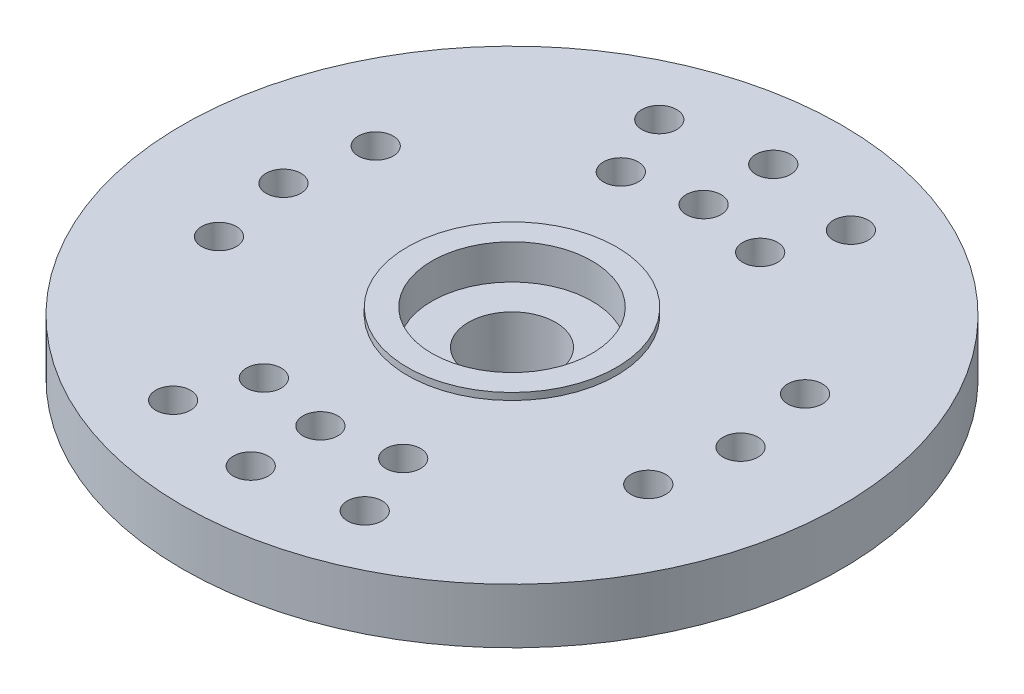
ISO-10303-21;
HEADER;
FILE_DESCRIPTION(('STEP AP214'),'2;1');
FILE_NAME('part.step','',(''),(''),'','','');
FILE_SCHEMA(('AUTOMOTIVE_DESIGN { 1 0 10303 214 1 1 1 1 }'));
ENDSEC;
DATA;
#1=APPLICATION_CONTEXT('core data for automotive mechanical design processes');
#2=APPLICATION_PROTOCOL_DEFINITION('international standard','automotive_design',2000,#1);
#3=PRODUCT_CONTEXT('',#1,'mechanical');
#4=PRODUCT('Part','Part','',(#3));
#5=PRODUCT_RELATED_PRODUCT_CATEGORY('part','',(#4));
#6=PRODUCT_DEFINITION_FORMATION('','',#4);
#7=PRODUCT_DEFINITION_CONTEXT('part definition',#1,'design');
#8=PRODUCT_DEFINITION('design','',#6,#7);
#9=PRODUCT_DEFINITION_SHAPE('','',#8);
#10=(LENGTH_UNIT() NAMED_UNIT(*) SI_UNIT(.MILLI.,.METRE.));
#11=(NAMED_UNIT(*) PLANE_ANGLE_UNIT() SI_UNIT($,.RADIAN.));
#12=(NAMED_UNIT(*) SI_UNIT($,.STERADIAN.) SOLID_ANGLE_UNIT());
#13=UNCERTAINTY_MEASURE_WITH_UNIT(LENGTH_MEASURE(1.E-05),#10,'distance_accuracy_value','');
#14=(GEOMETRIC_REPRESENTATION_CONTEXT(3) GLOBAL_UNCERTAINTY_ASSIGNED_CONTEXT((#13)) GLOBAL_UNIT_ASSIGNED_CONTEXT((#10,
#11,#12)) REPRESENTATION_CONTEXT('',''));
#15=CARTESIAN_POINT('',(0.,0.,0.));
#16=DIRECTION('',(0.,0.,1.));
#17=DIRECTION('',(1.,0.,0.));
#18=AXIS2_PLACEMENT_3D('',#15,#16,#17);
#19=CARTESIAN_POINT('',(4.5212,0.,0.));
#20=DIRECTION('',(0.,-1.,0.));
#21=DIRECTION('',(0.,0.,-1.));
#22=AXIS2_PLACEMENT_3D('',#19,#20,#21);
#23=PLANE('',#22);
#24=CARTESIAN_POINT('',(0.,0.,0.));
#25=DIRECTION('',(0.,-1.,0.));
#26=DIRECTION('',(0.,0.,-1.));
#27=AXIS2_PLACEMENT_3D('',#24,#25,#26);
#28=CIRCLE('',#27,1.5875);
#29=CARTESIAN_POINT('',(0.,0.,-1.5875));
#30=VERTEX_POINT('',#29);
#31=EDGE_CURVE('E54',#30,#30,#28,.T.);
#32=ORIENTED_EDGE('',*,*,#31,.F.);
#33=EDGE_LOOP('',(#32));
#34=FACE_BOUND('',#33,.T.);
#35=CARTESIAN_POINT('',(0.,0.,0.));
#36=DIRECTION('',(0.,-1.,0.));
#37=DIRECTION('',(0.,0.,-1.));
#38=AXIS2_PLACEMENT_3D('',#35,#36,#37);
#39=CIRCLE('',#38,4.5212);
#40=CARTESIAN_POINT('',(0.,0.,-4.5212));
#41=VERTEX_POINT('',#40);
#42=EDGE_CURVE('E168',#41,#41,#39,.T.);
#43=ORIENTED_EDGE('',*,*,#42,.T.);
#44=EDGE_LOOP('',(#43));
#45=FACE_BOUND('',#44,.T.);
#46=ADVANCED_FACE('F34',(#34,#45),#23,.T.);
#47=CARTESIAN_POINT('',(0.,4.445,0.));
#48=DIRECTION('',(0.,1.,0.));
#49=DIRECTION('',(0.,0.,1.));
#50=AXIS2_PLACEMENT_3D('',#47,#48,#49);
#51=PLANE('',#50);
#52=CARTESIAN_POINT('',(0.,4.445,0.));
#53=DIRECTION('',(0.,1.,0.));
#54=DIRECTION('',(0.,0.,1.));
#55=AXIS2_PLACEMENT_3D('',#52,#53,#54);
#56=CIRCLE('',#55,2.921);
#57=CARTESIAN_POINT('',(0.,4.445,2.921));
#58=VERTEX_POINT('',#57);
#59=EDGE_CURVE('E53',#58,#58,#56,.T.);
#60=ORIENTED_EDGE('',*,*,#59,.F.);
#61=EDGE_LOOP('',(#60));
#62=FACE_BOUND('',#61,.T.);
#63=CARTESIAN_POINT('',(0.,4.445,0.));
#64=DIRECTION('',(0.,-1.,0.));
#65=DIRECTION('',(0.,0.,-1.));
#66=AXIS2_PLACEMENT_3D('',#63,#64,#65);
#67=CIRCLE('',#66,3.81);
#68=CARTESIAN_POINT('',(0.,4.445,-3.81));
#69=VERTEX_POINT('',#68);
#70=EDGE_CURVE('E10',#69,#69,#67,.T.);
#71=ORIENTED_EDGE('',*,*,#70,.F.);
#72=EDGE_LOOP('',(#71));
#73=FACE_BOUND('',#72,.T.);
#74=ADVANCED_FACE('F195',(#62,#73),#51,.T.);
#75=CARTESIAN_POINT('',(0.,0.,0.));
#76=DIRECTION('',(0.,-1.,0.));
#77=DIRECTION('',(0.,0.,-1.));
#78=AXIS2_PLACEMENT_3D('',#75,#76,#77);
#79=CYLINDRICAL_SURFACE('',#78,3.81);
#80=ORIENTED_EDGE('',*,*,#70,.T.);
#81=EDGE_LOOP('',(#80));
#82=FACE_BOUND('',#81,.T.);
#83=CARTESIAN_POINT('',(0.,4.191,0.));
#84=DIRECTION('',(0.,-1.,0.));
#85=DIRECTION('',(0.,0.,-1.));
#86=AXIS2_PLACEMENT_3D('',#83,#84,#85);
#87=CIRCLE('',#86,3.81);
#88=CARTESIAN_POINT('',(0.,4.191,-3.81));
#89=VERTEX_POINT('',#88);
#90=EDGE_CURVE('E41',#89,#89,#87,.T.);
#91=ORIENTED_EDGE('',*,*,#90,.F.);
#92=EDGE_LOOP('',(#91));
#93=FACE_BOUND('',#92,.T.);
#94=ADVANCED_FACE('F186',(#82,#93),#79,.T.);
#95=CARTESIAN_POINT('',(3.81,4.191,0.));
#96=DIRECTION('',(0.,1.,0.));
#97=DIRECTION('',(0.,0.,1.));
#98=AXIS2_PLACEMENT_3D('',#95,#96,#97);
#99=PLANE('',#98);
#100=CARTESIAN_POINT('',(-3.4925,4.191,8.86160644296507));
#101=DIRECTION('',(0.,1.,0.));
#102=DIRECTION('',(0.,0.,1.));
#103=AXIS2_PLACEMENT_3D('',#100,#101,#102);
#104=CIRCLE('',#103,0.635);
#105=CARTESIAN_POINT('',(-3.4925,4.191,9.49660644296507));
#106=VERTEX_POINT('',#105);
#107=EDGE_CURVE('E130',#106,#106,#104,.T.);
#108=ORIENTED_EDGE('',*,*,#107,.F.);
#109=EDGE_LOOP('',(#108));
#110=FACE_BOUND('',#109,.T.);
#111=CARTESIAN_POINT('',(0.,4.191,9.525));
#112=DIRECTION('',(0.,1.,0.));
#113=DIRECTION('',(0.,0.,1.));
#114=AXIS2_PLACEMENT_3D('',#111,#112,#113);
#115=CIRCLE('',#114,0.635);
#116=CARTESIAN_POINT('',(0.,4.191,10.16));
#117=VERTEX_POINT('',#116);
#118=EDGE_CURVE('E120',#117,#117,#115,.T.);
#119=ORIENTED_EDGE('',*,*,#118,.F.);
#120=EDGE_LOOP('',(#119));
#121=FACE_BOUND('',#120,.T.);
#122=CARTESIAN_POINT('',(3.4925,4.191,8.86160644296507));
#123=DIRECTION('',(0.,1.,0.));
#124=DIRECTION('',(0.,0.,1.));
#125=AXIS2_PLACEMENT_3D('',#122,#123,#124);
#126=CIRCLE('',#125,0.635);
#127=CARTESIAN_POINT('',(3.4925,4.191,9.49660644296507));
#128=VERTEX_POINT('',#127);
#129=EDGE_CURVE('E117',#128,#128,#126,.T.);
#130=ORIENTED_EDGE('',*,*,#129,.F.);
#131=EDGE_LOOP('',(#130));
#132=FACE_BOUND('',#131,.T.);
#133=CARTESIAN_POINT('',(-3.4925,4.191,-8.86160644296507));
#134=DIRECTION('',(0.,1.,0.));
#135=DIRECTION('',(0.,0.,1.));
#136=AXIS2_PLACEMENT_3D('',#133,#134,#135);
#137=CIRCLE('',#136,0.635);
#138=CARTESIAN_POINT('',(-3.4925,4.191,-8.22660644296507));
#139=VERTEX_POINT('',#138);
#140=EDGE_CURVE('E114',#139,#139,#137,.T.);
#141=ORIENTED_EDGE('',*,*,#140,.F.);
#142=EDGE_LOOP('',(#141));
#143=FACE_BOUND('',#142,.T.);
#144=CARTESIAN_POINT('',(3.4925,4.191,-8.86160644296507));
#145=DIRECTION('',(0.,1.,0.));
#146=DIRECTION('',(0.,0.,1.));
#147=AXIS2_PLACEMENT_3D('',#144,#145,#146);
#148=CIRCLE('',#147,0.634999999999999);
#149=CARTESIAN_POINT('',(3.4925,4.191,-8.22660644296507));
#150=VERTEX_POINT('',#149);
#151=EDGE_CURVE('E110',#150,#150,#148,.T.);
#152=ORIENTED_EDGE('',*,*,#151,.F.);
#153=EDGE_LOOP('',(#152));
#154=FACE_BOUND('',#153,.T.);
#155=CARTESIAN_POINT('',(0.,4.191,-9.525));
#156=DIRECTION('',(0.,1.,0.));
#157=DIRECTION('',(0.,0.,1.));
#158=AXIS2_PLACEMENT_3D('',#155,#156,#157);
#159=CIRCLE('',#158,0.635);
#160=CARTESIAN_POINT('',(0.,4.191,-8.89));
#161=VERTEX_POINT('',#160);
#162=EDGE_CURVE('E106',#161,#161,#159,.T.);
#163=ORIENTED_EDGE('',*,*,#162,.F.);
#164=EDGE_LOOP('',(#163));
#165=FACE_BOUND('',#164,.T.);
#166=CARTESIAN_POINT('',(-2.54,4.191,6.50681373638435));
#167=DIRECTION('',(0.,1.,0.));
#168=DIRECTION('',(0.,0.,1.));
#169=AXIS2_PLACEMENT_3D('',#166,#167,#168);
#170=CIRCLE('',#169,0.635);
#171=CARTESIAN_POINT('',(-2.54,4.191,7.14181373638435));
#172=VERTEX_POINT('',#171);
#173=EDGE_CURVE('E102',#172,#172,#170,.T.);
#174=ORIENTED_EDGE('',*,*,#173,.F.);
#175=EDGE_LOOP('',(#174));
#176=FACE_BOUND('',#175,.T.);
#177=CARTESIAN_POINT('',(0.,4.191,6.985));
#178=DIRECTION('',(0.,1.,0.));
#179=DIRECTION('',(0.,0.,1.));
#180=AXIS2_PLACEMENT_3D('',#177,#178,#179);
#181=CIRCLE('',#180,0.635);
#182=CARTESIAN_POINT('',(0.,4.191,7.62));
#183=VERTEX_POINT('',#182);
#184=EDGE_CURVE('E98',#183,#183,#181,.T.);
#185=ORIENTED_EDGE('',*,*,#184,.F.);
#186=EDGE_LOOP('',(#185));
#187=FACE_BOUND('',#186,.T.);
#188=CARTESIAN_POINT('',(2.54,4.191,6.50681373638435));
#189=DIRECTION('',(0.,1.,0.));
#190=DIRECTION('',(0.,0.,1.));
#191=AXIS2_PLACEMENT_3D('',#188,#189,#190);
#192=CIRCLE('',#191,0.635);
#193=CARTESIAN_POINT('',(2.54,4.191,7.14181373638435));
#194=VERTEX_POINT('',#193);
#195=EDGE_CURVE('E94',#194,#194,#192,.T.);
#196=ORIENTED_EDGE('',*,*,#195,.F.);
#197=EDGE_LOOP('',(#196));
#198=FACE_BOUND('',#197,.T.);
#199=CARTESIAN_POINT('',(-2.54,4.191,-6.50681373638435));
#200=DIRECTION('',(0.,1.,0.));
#201=DIRECTION('',(0.,0.,1.));
#202=AXIS2_PLACEMENT_3D('',#199,#200,#201);
#203=CIRCLE('',#202,0.635);
#204=CARTESIAN_POINT('',(-2.54,4.191,-5.87181373638435));
#205=VERTEX_POINT('',#204);
#206=EDGE_CURVE('E90',#205,#205,#203,.T.);
#207=ORIENTED_EDGE('',*,*,#206,.F.);
#208=EDGE_LOOP('',(#207));
#209=FACE_BOUND('',#208,.T.);
#210=CARTESIAN_POINT('',(2.54,4.191,-6.50681373638435));
#211=DIRECTION('',(0.,1.,0.));
#212=DIRECTION('',(0.,0.,1.));
#213=AXIS2_PLACEMENT_3D('',#210,#211,#212);
#214=CIRCLE('',#213,0.635);
#215=CARTESIAN_POINT('',(2.54,4.191,-5.87181373638435));
#216=VERTEX_POINT('',#215);
#217=EDGE_CURVE('E86',#216,#216,#214,.T.);
#218=ORIENTED_EDGE('',*,*,#217,.F.);
#219=EDGE_LOOP('',(#218));
#220=FACE_BOUND('',#219,.T.);
#221=CARTESIAN_POINT('',(7.82582821112245,4.191,2.8575));
#222=DIRECTION('',(0.,1.,0.));
#223=DIRECTION('',(0.,0.,1.));
#224=AXIS2_PLACEMENT_3D('',#221,#222,#223);
#225=CIRCLE('',#224,0.635000000000001);
#226=CARTESIAN_POINT('',(7.82582821112245,4.191,3.4925));
#227=VERTEX_POINT('',#226);
#228=EDGE_CURVE('E82',#227,#227,#225,.T.);
#229=ORIENTED_EDGE('',*,*,#228,.F.);
#230=EDGE_LOOP('',(#229));
#231=FACE_BOUND('',#230,.T.);
#232=CARTESIAN_POINT('',(8.3312,4.191,0.));
#233=DIRECTION('',(0.,1.,0.));
#234=DIRECTION('',(0.,0.,1.));
#235=AXIS2_PLACEMENT_3D('',#232,#233,#234);
#236=CIRCLE('',#235,0.635000000000001);
#237=CARTESIAN_POINT('',(8.3312,4.191,0.635000000000002));
#238=VERTEX_POINT('',#237);
#239=EDGE_CURVE('E78',#238,#238,#236,.T.);
#240=ORIENTED_EDGE('',*,*,#239,.F.);
#241=EDGE_LOOP('',(#240));
#242=FACE_BOUND('',#241,.T.);
#243=CARTESIAN_POINT('',(7.82582821112245,4.191,-2.8575));
#244=DIRECTION('',(0.,1.,0.));
#245=DIRECTION('',(0.,0.,1.));
#246=AXIS2_PLACEMENT_3D('',#243,#244,#245);
#247=CIRCLE('',#246,0.635000000000001);
#248=CARTESIAN_POINT('',(7.82582821112245,4.191,-2.2225));
#249=VERTEX_POINT('',#248);
#250=EDGE_CURVE('E74',#249,#249,#247,.T.);
#251=ORIENTED_EDGE('',*,*,#250,.F.);
#252=EDGE_LOOP('',(#251));
#253=FACE_BOUND('',#252,.T.);
#254=CARTESIAN_POINT('',(-7.82582821112245,4.191,2.8575));
#255=DIRECTION('',(0.,1.,0.));
#256=DIRECTION('',(0.,0.,1.));
#257=AXIS2_PLACEMENT_3D('',#254,#255,#256);
#258=CIRCLE('',#257,0.635000000000001);
#259=CARTESIAN_POINT('',(-7.82582821112245,4.191,3.4925));
#260=VERTEX_POINT('',#259);
#261=EDGE_CURVE('E70',#260,#260,#258,.T.);
#262=ORIENTED_EDGE('',*,*,#261,.F.);
#263=EDGE_LOOP('',(#262));
#264=FACE_BOUND('',#263,.T.);
#265=CARTESIAN_POINT('',(-8.3312,4.191,0.));
#266=DIRECTION('',(0.,1.,0.));
#267=DIRECTION('',(0.,0.,1.));
#268=AXIS2_PLACEMENT_3D('',#265,#266,#267);
#269=CIRCLE('',#268,0.635000000000001);
#270=CARTESIAN_POINT('',(-8.3312,4.191,0.635000000000002));
#271=VERTEX_POINT('',#270);
#272=EDGE_CURVE('E66',#271,#271,#269,.T.);
#273=ORIENTED_EDGE('',*,*,#272,.F.);
#274=EDGE_LOOP('',(#273));
#275=FACE_BOUND('',#274,.T.);
#276=CARTESIAN_POINT('',(-7.82582821112245,4.191,-2.8575));
#277=DIRECTION('',(0.,1.,0.));
#278=DIRECTION('',(0.,0.,1.));
#279=AXIS2_PLACEMENT_3D('',#276,#277,#278);
#280=CIRCLE('',#279,0.635000000000001);
#281=CARTESIAN_POINT('',(-7.82582821112245,4.191,-2.2225));
#282=VERTEX_POINT('',#281);
#283=EDGE_CURVE('E62',#282,#282,#280,.T.);
#284=ORIENTED_EDGE('',*,*,#283,.F.);
#285=EDGE_LOOP('',(#284));
#286=FACE_BOUND('',#285,.T.);
#287=CARTESIAN_POINT('',(0.,4.191,-6.985));
#288=DIRECTION('',(0.,1.,0.));
#289=DIRECTION('',(0.,0.,1.));
#290=AXIS2_PLACEMENT_3D('',#287,#288,#289);
#291=CIRCLE('',#290,0.635);
#292=CARTESIAN_POINT('',(0.,4.191,-6.35));
#293=VERTEX_POINT('',#292);
#294=EDGE_CURVE('E58',#293,#293,#291,.T.);
#295=ORIENTED_EDGE('',*,*,#294,.F.);
#296=EDGE_LOOP('',(#295));
#297=FACE_BOUND('',#296,.T.);
#298=ORIENTED_EDGE('',*,*,#90,.T.);
#299=EDGE_LOOP('',(#298));
#300=FACE_BOUND('',#299,.T.);
#301=CARTESIAN_POINT('',(0.,4.191,0.));
#302=DIRECTION('',(0.,-1.,0.));
#303=DIRECTION('',(0.,0.,-1.));
#304=AXIS2_PLACEMENT_3D('',#301,#302,#303);
#305=CIRCLE('',#304,12.0142);
#306=CARTESIAN_POINT('',(0.,4.191,-12.0142));
#307=VERTEX_POINT('',#306);
#308=EDGE_CURVE('E46',#307,#307,#305,.T.);
#309=ORIENTED_EDGE('',*,*,#308,.F.);
#310=EDGE_LOOP('',(#309));
#311=FACE_BOUND('',#310,.T.);
#312=ADVANCED_FACE('F184',(#110,#121,#132,#143,#154,#165,#176,#187,#198,#209,#220,#231,#242,
#253,#264,#275,#286,#297,#300,#311),#99,.T.);
#313=CARTESIAN_POINT('',(0.,0.,0.));
#314=DIRECTION('',(0.,-1.,0.));
#315=DIRECTION('',(0.,0.,-1.));
#316=AXIS2_PLACEMENT_3D('',#313,#314,#315);
#317=CYLINDRICAL_SURFACE('',#316,12.0142);
#318=ORIENTED_EDGE('',*,*,#308,.T.);
#319=EDGE_LOOP('',(#318));
#320=FACE_BOUND('',#319,.T.);
#321=CARTESIAN_POINT('',(0.,2.1844,0.));
#322=DIRECTION('',(0.,-1.,0.));
#323=DIRECTION('',(0.,0.,-1.));
#324=AXIS2_PLACEMENT_3D('',#321,#322,#323);
#325=CIRCLE('',#324,12.0142);
#326=CARTESIAN_POINT('',(0.,2.1844,-12.0142));
#327=VERTEX_POINT('',#326);
#328=EDGE_CURVE('E176',#327,#327,#325,.T.);
#329=ORIENTED_EDGE('',*,*,#328,.F.);
#330=EDGE_LOOP('',(#329));
#331=FACE_BOUND('',#330,.T.);
#332=ADVANCED_FACE('F181',(#320,#331),#317,.T.);
#333=CARTESIAN_POINT('',(12.0142,2.1844,0.));
#334=DIRECTION('',(0.,-1.,0.));
#335=DIRECTION('',(0.,0.,-1.));
#336=AXIS2_PLACEMENT_3D('',#333,#334,#335);
#337=PLANE('',#336);
#338=CARTESIAN_POINT('',(-3.4925,2.1844,8.86160644296507));
#339=DIRECTION('',(0.,-1.,0.));
#340=DIRECTION('',(0.,0.,-1.));
#341=AXIS2_PLACEMENT_3D('',#338,#339,#340);
#342=CIRCLE('',#341,0.635);
#343=CARTESIAN_POINT('',(-3.4925,2.1844,8.22660644296507));
#344=VERTEX_POINT('',#343);
#345=EDGE_CURVE('E37',#344,#344,#342,.T.);
#346=ORIENTED_EDGE('',*,*,#345,.F.);
#347=EDGE_LOOP('',(#346));
#348=FACE_BOUND('',#347,.T.);
#349=CARTESIAN_POINT('',(0.,2.1844,9.525));
#350=DIRECTION('',(0.,-1.,0.));
#351=DIRECTION('',(0.,0.,-1.));
#352=AXIS2_PLACEMENT_3D('',#349,#350,#351);
#353=CIRCLE('',#352,0.635);
#354=CARTESIAN_POINT('',(0.,2.1844,8.89));
#355=VERTEX_POINT('',#354);
#356=EDGE_CURVE('E118',#355,#355,#353,.T.);
#357=ORIENTED_EDGE('',*,*,#356,.F.);
#358=EDGE_LOOP('',(#357));
#359=FACE_BOUND('',#358,.T.);
#360=CARTESIAN_POINT('',(3.4925,2.1844,8.86160644296507));
#361=DIRECTION('',(0.,-1.,0.));
#362=DIRECTION('',(0.,0.,-1.));
#363=AXIS2_PLACEMENT_3D('',#360,#361,#362);
#364=CIRCLE('',#363,0.635);
#365=CARTESIAN_POINT('',(3.4925,2.1844,8.22660644296507));
#366=VERTEX_POINT('',#365);
#367=EDGE_CURVE('E115',#366,#366,#364,.T.);
#368=ORIENTED_EDGE('',*,*,#367,.F.);
#369=EDGE_LOOP('',(#368));
#370=FACE_BOUND('',#369,.T.);
#371=CARTESIAN_POINT('',(-3.4925,2.1844,-8.86160644296507));
#372=DIRECTION('',(0.,-1.,0.));
#373=DIRECTION('',(0.,0.,-1.));
#374=AXIS2_PLACEMENT_3D('',#371,#372,#373);
#375=CIRCLE('',#374,0.635);
#376=CARTESIAN_POINT('',(-3.4925,2.1844,-9.49660644296507));
#377=VERTEX_POINT('',#376);
#378=EDGE_CURVE('E111',#377,#377,#375,.T.);
#379=ORIENTED_EDGE('',*,*,#378,.F.);
#380=EDGE_LOOP('',(#379));
#381=FACE_BOUND('',#380,.T.);
#382=CARTESIAN_POINT('',(3.4925,2.1844,-8.86160644296507));
#383=DIRECTION('',(0.,-1.,0.));
#384=DIRECTION('',(0.,0.,-1.));
#385=AXIS2_PLACEMENT_3D('',#382,#383,#384);
#386=CIRCLE('',#385,0.634999999999999);
#387=CARTESIAN_POINT('',(3.4925,2.1844,-9.49660644296507));
#388=VERTEX_POINT('',#387);
#389=EDGE_CURVE('E107',#388,#388,#386,.T.);
#390=ORIENTED_EDGE('',*,*,#389,.F.);
#391=EDGE_LOOP('',(#390));
#392=FACE_BOUND('',#391,.T.);
#393=CARTESIAN_POINT('',(0.,2.1844,-9.525));
#394=DIRECTION('',(0.,-1.,0.));
#395=DIRECTION('',(0.,0.,-1.));
#396=AXIS2_PLACEMENT_3D('',#393,#394,#395);
#397=CIRCLE('',#396,0.635);
#398=CARTESIAN_POINT('',(0.,2.1844,-10.16));
#399=VERTEX_POINT('',#398);
#400=EDGE_CURVE('E103',#399,#399,#397,.T.);
#401=ORIENTED_EDGE('',*,*,#400,.F.);
#402=EDGE_LOOP('',(#401));
#403=FACE_BOUND('',#402,.T.);
#404=CARTESIAN_POINT('',(-2.54,2.1844,6.50681373638435));
#405=DIRECTION('',(0.,-1.,0.));
#406=DIRECTION('',(0.,0.,-1.));
#407=AXIS2_PLACEMENT_3D('',#404,#405,#406);
#408=CIRCLE('',#407,0.635);
#409=CARTESIAN_POINT('',(-2.54,2.1844,5.87181373638435));
#410=VERTEX_POINT('',#409);
#411=EDGE_CURVE('E99',#410,#410,#408,.T.);
#412=ORIENTED_EDGE('',*,*,#411,.F.);
#413=EDGE_LOOP('',(#412));
#414=FACE_BOUND('',#413,.T.);
#415=CARTESIAN_POINT('',(0.,2.1844,6.985));
#416=DIRECTION('',(0.,-1.,0.));
#417=DIRECTION('',(0.,0.,-1.));
#418=AXIS2_PLACEMENT_3D('',#415,#416,#417);
#419=CIRCLE('',#418,0.635);
#420=CARTESIAN_POINT('',(0.,2.1844,6.35));
#421=VERTEX_POINT('',#420);
#422=EDGE_CURVE('E95',#421,#421,#419,.T.);
#423=ORIENTED_EDGE('',*,*,#422,.F.);
#424=EDGE_LOOP('',(#423));
#425=FACE_BOUND('',#424,.T.);
#426=CARTESIAN_POINT('',(2.54,2.1844,6.50681373638435));
#427=DIRECTION('',(0.,-1.,0.));
#428=DIRECTION('',(0.,0.,-1.));
#429=AXIS2_PLACEMENT_3D('',#426,#427,#428);
#430=CIRCLE('',#429,0.635);
#431=CARTESIAN_POINT('',(2.54,2.1844,5.87181373638435));
#432=VERTEX_POINT('',#431);
#433=EDGE_CURVE('E91',#432,#432,#430,.T.);
#434=ORIENTED_EDGE('',*,*,#433,.F.);
#435=EDGE_LOOP('',(#434));
#436=FACE_BOUND('',#435,.T.);
#437=CARTESIAN_POINT('',(-2.54,2.1844,-6.50681373638435));
#438=DIRECTION('',(0.,-1.,0.));
#439=DIRECTION('',(0.,0.,-1.));
#440=AXIS2_PLACEMENT_3D('',#437,#438,#439);
#441=CIRCLE('',#440,0.635);
#442=CARTESIAN_POINT('',(-2.54,2.1844,-7.14181373638435));
#443=VERTEX_POINT('',#442);
#444=EDGE_CURVE('E87',#443,#443,#441,.T.);
#445=ORIENTED_EDGE('',*,*,#444,.F.);
#446=EDGE_LOOP('',(#445));
#447=FACE_BOUND('',#446,.T.);
#448=CARTESIAN_POINT('',(2.54,2.1844,-6.50681373638435));
#449=DIRECTION('',(0.,-1.,0.));
#450=DIRECTION('',(0.,0.,-1.));
#451=AXIS2_PLACEMENT_3D('',#448,#449,#450);
#452=CIRCLE('',#451,0.635);
#453=CARTESIAN_POINT('',(2.54,2.1844,-7.14181373638435));
#454=VERTEX_POINT('',#453);
#455=EDGE_CURVE('E83',#454,#454,#452,.T.);
#456=ORIENTED_EDGE('',*,*,#455,.F.);
#457=EDGE_LOOP('',(#456));
#458=FACE_BOUND('',#457,.T.);
#459=CARTESIAN_POINT('',(7.82582821112245,2.1844,2.8575));
#460=DIRECTION('',(0.,-1.,0.));
#461=DIRECTION('',(0.,0.,-1.));
#462=AXIS2_PLACEMENT_3D('',#459,#460,#461);
#463=CIRCLE('',#462,0.635000000000001);
#464=CARTESIAN_POINT('',(7.82582821112245,2.1844,2.2225));
#465=VERTEX_POINT('',#464);
#466=EDGE_CURVE('E79',#465,#465,#463,.T.);
#467=ORIENTED_EDGE('',*,*,#466,.F.);
#468=EDGE_LOOP('',(#467));
#469=FACE_BOUND('',#468,.T.);
#470=CARTESIAN_POINT('',(8.3312,2.1844,0.));
#471=DIRECTION('',(0.,-1.,0.));
#472=DIRECTION('',(0.,0.,-1.));
#473=AXIS2_PLACEMENT_3D('',#470,#471,#472);
#474=CIRCLE('',#473,0.635000000000001);
#475=CARTESIAN_POINT('',(8.3312,2.1844,-0.635));
#476=VERTEX_POINT('',#475);
#477=EDGE_CURVE('E75',#476,#476,#474,.T.);
#478=ORIENTED_EDGE('',*,*,#477,.F.);
#479=EDGE_LOOP('',(#478));
#480=FACE_BOUND('',#479,.T.);
#481=CARTESIAN_POINT('',(7.82582821112245,2.1844,-2.8575));
#482=DIRECTION('',(0.,-1.,0.));
#483=DIRECTION('',(0.,0.,-1.));
#484=AXIS2_PLACEMENT_3D('',#481,#482,#483);
#485=CIRCLE('',#484,0.635000000000001);
#486=CARTESIAN_POINT('',(7.82582821112245,2.1844,-3.4925));
#487=VERTEX_POINT('',#486);
#488=EDGE_CURVE('E71',#487,#487,#485,.T.);
#489=ORIENTED_EDGE('',*,*,#488,.F.);
#490=EDGE_LOOP('',(#489));
#491=FACE_BOUND('',#490,.T.);
#492=CARTESIAN_POINT('',(-7.82582821112245,2.1844,2.8575));
#493=DIRECTION('',(0.,-1.,0.));
#494=DIRECTION('',(0.,0.,-1.));
#495=AXIS2_PLACEMENT_3D('',#492,#493,#494);
#496=CIRCLE('',#495,0.635000000000001);
#497=CARTESIAN_POINT('',(-7.82582821112245,2.1844,2.2225));
#498=VERTEX_POINT('',#497);
#499=EDGE_CURVE('E67',#498,#498,#496,.T.);
#500=ORIENTED_EDGE('',*,*,#499,.F.);
#501=EDGE_LOOP('',(#500));
#502=FACE_BOUND('',#501,.T.);
#503=CARTESIAN_POINT('',(-8.3312,2.1844,0.));
#504=DIRECTION('',(0.,-1.,0.));
#505=DIRECTION('',(0.,0.,-1.));
#506=AXIS2_PLACEMENT_3D('',#503,#504,#505);
#507=CIRCLE('',#506,0.635000000000001);
#508=CARTESIAN_POINT('',(-8.3312,2.1844,-0.635));
#509=VERTEX_POINT('',#508);
#510=EDGE_CURVE('E63',#509,#509,#507,.T.);
#511=ORIENTED_EDGE('',*,*,#510,.F.);
#512=EDGE_LOOP('',(#511));
#513=FACE_BOUND('',#512,.T.);
#514=CARTESIAN_POINT('',(-7.82582821112245,2.1844,-2.8575));
#515=DIRECTION('',(0.,-1.,0.));
#516=DIRECTION('',(0.,0.,-1.));
#517=AXIS2_PLACEMENT_3D('',#514,#515,#516);
#518=CIRCLE('',#517,0.635000000000001);
#519=CARTESIAN_POINT('',(-7.82582821112245,2.1844,-3.4925));
#520=VERTEX_POINT('',#519);
#521=EDGE_CURVE('E59',#520,#520,#518,.T.);
#522=ORIENTED_EDGE('',*,*,#521,.F.);
#523=EDGE_LOOP('',(#522));
#524=FACE_BOUND('',#523,.T.);
#525=CARTESIAN_POINT('',(0.,2.1844,-6.985));
#526=DIRECTION('',(0.,-1.,0.));
#527=DIRECTION('',(0.,0.,-1.));
#528=AXIS2_PLACEMENT_3D('',#525,#526,#527);
#529=CIRCLE('',#528,0.635);
#530=CARTESIAN_POINT('',(0.,2.1844,-7.62));
#531=VERTEX_POINT('',#530);
#532=EDGE_CURVE('E55',#531,#531,#529,.T.);
#533=ORIENTED_EDGE('',*,*,#532,.F.);
#534=EDGE_LOOP('',(#533));
#535=FACE_BOUND('',#534,.T.);
#536=ORIENTED_EDGE('',*,*,#328,.T.);
#537=EDGE_LOOP('',(#536));
#538=FACE_BOUND('',#537,.T.);
#539=CARTESIAN_POINT('',(0.,2.1844,0.));
#540=DIRECTION('',(0.,-1.,0.));
#541=DIRECTION('',(0.,0.,-1.));
#542=AXIS2_PLACEMENT_3D('',#539,#540,#541);
#543=CIRCLE('',#542,4.5212);
#544=CARTESIAN_POINT('',(0.,2.1844,-4.5212));
#545=VERTEX_POINT('',#544);
#546=EDGE_CURVE('E173',#545,#545,#543,.T.);
#547=ORIENTED_EDGE('',*,*,#546,.F.);
#548=EDGE_LOOP('',(#547));
#549=FACE_BOUND('',#548,.T.);
#550=ADVANCED_FACE('F193',(#348,#359,#370,#381,#392,#403,#414,#425,#436,#447,#458,#469,#480,
#491,#502,#513,#524,#535,#538,#549),#337,.T.);
#551=CARTESIAN_POINT('',(0.,0.,0.));
#552=DIRECTION('',(0.,-1.,0.));
#553=DIRECTION('',(0.,0.,-1.));
#554=AXIS2_PLACEMENT_3D('',#551,#552,#553);
#555=CYLINDRICAL_SURFACE('',#554,4.5212);
#556=ORIENTED_EDGE('',*,*,#546,.T.);
#557=EDGE_LOOP('',(#556));
#558=FACE_BOUND('',#557,.T.);
#559=ORIENTED_EDGE('',*,*,#42,.F.);
#560=EDGE_LOOP('',(#559));
#561=FACE_BOUND('',#560,.T.);
#562=ADVANCED_FACE('F209',(#558,#561),#555,.T.);
#563=CARTESIAN_POINT('',(0.,3.175,0.));
#564=DIRECTION('',(0.,1.,0.));
#565=DIRECTION('',(0.,0.,1.));
#566=AXIS2_PLACEMENT_3D('',#563,#564,#565);
#567=CYLINDRICAL_SURFACE('',#566,2.921);
#568=CARTESIAN_POINT('',(0.,3.175,0.));
#569=DIRECTION('',(0.,1.,0.));
#570=DIRECTION('',(0.,0.,1.));
#571=AXIS2_PLACEMENT_3D('',#568,#569,#570);
#572=CIRCLE('',#571,2.921);
#573=CARTESIAN_POINT('',(0.,3.175,2.921));
#574=VERTEX_POINT('',#573);
#575=EDGE_CURVE('E165',#574,#574,#572,.T.);
#576=ORIENTED_EDGE('',*,*,#575,.F.);
#577=EDGE_LOOP('',(#576));
#578=FACE_BOUND('',#577,.T.);
#579=ORIENTED_EDGE('',*,*,#59,.T.);
#580=EDGE_LOOP('',(#579));
#581=FACE_BOUND('',#580,.T.);
#582=ADVANCED_FACE('F211',(#578,#581),#567,.F.);
#583=CARTESIAN_POINT('',(0.,3.175,0.));
#584=DIRECTION('',(0.,1.,0.));
#585=DIRECTION('',(0.,0.,1.));
#586=AXIS2_PLACEMENT_3D('',#583,#584,#585);
#587=PLANE('',#586);
#588=CARTESIAN_POINT('',(0.,3.175,0.));
#589=DIRECTION('',(0.,1.,0.));
#590=DIRECTION('',(0.,0.,1.));
#591=AXIS2_PLACEMENT_3D('',#588,#589,#590);
#592=CIRCLE('',#591,1.5875);
#593=CARTESIAN_POINT('',(0.,3.175,1.5875));
#594=VERTEX_POINT('',#593);
#595=EDGE_CURVE('E50',#594,#594,#592,.T.);
#596=ORIENTED_EDGE('',*,*,#595,.F.);
#597=EDGE_LOOP('',(#596));
#598=FACE_BOUND('',#597,.T.);
#599=ORIENTED_EDGE('',*,*,#575,.T.);
#600=EDGE_LOOP('',(#599));
#601=FACE_BOUND('',#600,.T.);
#602=ADVANCED_FACE('F218',(#598,#601),#587,.T.);
#603=CARTESIAN_POINT('',(0.,4.445,0.));
#604=DIRECTION('',(0.,-1.,0.));
#605=DIRECTION('',(0.,0.,-1.));
#606=AXIS2_PLACEMENT_3D('',#603,#604,#605);
#607=CYLINDRICAL_SURFACE('',#606,1.5875);
#608=ORIENTED_EDGE('',*,*,#595,.T.);
#609=EDGE_LOOP('',(#608));
#610=FACE_BOUND('',#609,.T.);
#611=ORIENTED_EDGE('',*,*,#31,.T.);
#612=EDGE_LOOP('',(#611));
#613=FACE_BOUND('',#612,.T.);
#614=ADVANCED_FACE('F226',(#610,#613),#607,.F.);
#615=CARTESIAN_POINT('',(0.,0.,-6.985));
#616=DIRECTION('',(0.,1.,0.));
#617=DIRECTION('',(0.,0.,1.));
#618=AXIS2_PLACEMENT_3D('',#615,#616,#617);
#619=CYLINDRICAL_SURFACE('',#618,0.635);
#620=ORIENTED_EDGE('',*,*,#532,.T.);
#621=EDGE_LOOP('',(#620));
#622=FACE_BOUND('',#621,.T.);
#623=ORIENTED_EDGE('',*,*,#294,.T.);
#624=EDGE_LOOP('',(#623));
#625=FACE_BOUND('',#624,.T.);
#626=ADVANCED_FACE('F230',(#622,#625),#619,.F.);
#627=CARTESIAN_POINT('',(-7.82582821112245,0.,-2.8575));
#628=DIRECTION('',(0.,1.,0.));
#629=DIRECTION('',(0.,0.,1.));
#630=AXIS2_PLACEMENT_3D('',#627,#628,#629);
#631=CYLINDRICAL_SURFACE('',#630,0.635000000000001);
#632=ORIENTED_EDGE('',*,*,#521,.T.);
#633=EDGE_LOOP('',(#632));
#634=FACE_BOUND('',#633,.T.);
#635=ORIENTED_EDGE('',*,*,#283,.T.);
#636=EDGE_LOOP('',(#635));
#637=FACE_BOUND('',#636,.T.);
#638=ADVANCED_FACE('F234',(#634,#637),#631,.F.);
#639=CARTESIAN_POINT('',(-8.3312,0.,0.));
#640=DIRECTION('',(0.,1.,0.));
#641=DIRECTION('',(0.,0.,1.));
#642=AXIS2_PLACEMENT_3D('',#639,#640,#641);
#643=CYLINDRICAL_SURFACE('',#642,0.635000000000001);
#644=ORIENTED_EDGE('',*,*,#510,.T.);
#645=EDGE_LOOP('',(#644));
#646=FACE_BOUND('',#645,.T.);
#647=ORIENTED_EDGE('',*,*,#272,.T.);
#648=EDGE_LOOP('',(#647));
#649=FACE_BOUND('',#648,.T.);
#650=ADVANCED_FACE('F238',(#646,#649),#643,.F.);
#651=CARTESIAN_POINT('',(-7.82582821112245,0.,2.8575));
#652=DIRECTION('',(0.,1.,0.));
#653=DIRECTION('',(0.,0.,1.));
#654=AXIS2_PLACEMENT_3D('',#651,#652,#653);
#655=CYLINDRICAL_SURFACE('',#654,0.635000000000001);
#656=ORIENTED_EDGE('',*,*,#499,.T.);
#657=EDGE_LOOP('',(#656));
#658=FACE_BOUND('',#657,.T.);
#659=ORIENTED_EDGE('',*,*,#261,.T.);
#660=EDGE_LOOP('',(#659));
#661=FACE_BOUND('',#660,.T.);
#662=ADVANCED_FACE('F242',(#658,#661),#655,.F.);
#663=CARTESIAN_POINT('',(7.82582821112245,0.,-2.8575));
#664=DIRECTION('',(0.,1.,0.));
#665=DIRECTION('',(0.,0.,1.));
#666=AXIS2_PLACEMENT_3D('',#663,#664,#665);
#667=CYLINDRICAL_SURFACE('',#666,0.635000000000001);
#668=ORIENTED_EDGE('',*,*,#488,.T.);
#669=EDGE_LOOP('',(#668));
#670=FACE_BOUND('',#669,.T.);
#671=ORIENTED_EDGE('',*,*,#250,.T.);
#672=EDGE_LOOP('',(#671));
#673=FACE_BOUND('',#672,.T.);
#674=ADVANCED_FACE('F246',(#670,#673),#667,.F.);
#675=CARTESIAN_POINT('',(8.3312,0.,0.));
#676=DIRECTION('',(0.,1.,0.));
#677=DIRECTION('',(0.,0.,1.));
#678=AXIS2_PLACEMENT_3D('',#675,#676,#677);
#679=CYLINDRICAL_SURFACE('',#678,0.635000000000001);
#680=ORIENTED_EDGE('',*,*,#477,.T.);
#681=EDGE_LOOP('',(#680));
#682=FACE_BOUND('',#681,.T.);
#683=ORIENTED_EDGE('',*,*,#239,.T.);
#684=EDGE_LOOP('',(#683));
#685=FACE_BOUND('',#684,.T.);
#686=ADVANCED_FACE('F250',(#682,#685),#679,.F.);
#687=CARTESIAN_POINT('',(7.82582821112245,0.,2.8575));
#688=DIRECTION('',(0.,1.,0.));
#689=DIRECTION('',(0.,0.,1.));
#690=AXIS2_PLACEMENT_3D('',#687,#688,#689);
#691=CYLINDRICAL_SURFACE('',#690,0.635000000000001);
#692=ORIENTED_EDGE('',*,*,#466,.T.);
#693=EDGE_LOOP('',(#692));
#694=FACE_BOUND('',#693,.T.);
#695=ORIENTED_EDGE('',*,*,#228,.T.);
#696=EDGE_LOOP('',(#695));
#697=FACE_BOUND('',#696,.T.);
#698=ADVANCED_FACE('F254',(#694,#697),#691,.F.);
#699=CARTESIAN_POINT('',(2.54,0.,-6.50681373638435));
#700=DIRECTION('',(0.,1.,0.));
#701=DIRECTION('',(0.,0.,1.));
#702=AXIS2_PLACEMENT_3D('',#699,#700,#701);
#703=CYLINDRICAL_SURFACE('',#702,0.635);
#704=ORIENTED_EDGE('',*,*,#455,.T.);
#705=EDGE_LOOP('',(#704));
#706=FACE_BOUND('',#705,.T.);
#707=ORIENTED_EDGE('',*,*,#217,.T.);
#708=EDGE_LOOP('',(#707));
#709=FACE_BOUND('',#708,.T.);
#710=ADVANCED_FACE('F258',(#706,#709),#703,.F.);
#711=CARTESIAN_POINT('',(-2.54,0.,-6.50681373638435));
#712=DIRECTION('',(0.,1.,0.));
#713=DIRECTION('',(0.,0.,1.));
#714=AXIS2_PLACEMENT_3D('',#711,#712,#713);
#715=CYLINDRICAL_SURFACE('',#714,0.635);
#716=ORIENTED_EDGE('',*,*,#444,.T.);
#717=EDGE_LOOP('',(#716));
#718=FACE_BOUND('',#717,.T.);
#719=ORIENTED_EDGE('',*,*,#206,.T.);
#720=EDGE_LOOP('',(#719));
#721=FACE_BOUND('',#720,.T.);
#722=ADVANCED_FACE('F262',(#718,#721),#715,.F.);
#723=CARTESIAN_POINT('',(2.54,0.,6.50681373638435));
#724=DIRECTION('',(0.,1.,0.));
#725=DIRECTION('',(0.,0.,1.));
#726=AXIS2_PLACEMENT_3D('',#723,#724,#725);
#727=CYLINDRICAL_SURFACE('',#726,0.635);
#728=ORIENTED_EDGE('',*,*,#433,.T.);
#729=EDGE_LOOP('',(#728));
#730=FACE_BOUND('',#729,.T.);
#731=ORIENTED_EDGE('',*,*,#195,.T.);
#732=EDGE_LOOP('',(#731));
#733=FACE_BOUND('',#732,.T.);
#734=ADVANCED_FACE('F266',(#730,#733),#727,.F.);
#735=CARTESIAN_POINT('',(0.,0.,6.985));
#736=DIRECTION('',(0.,1.,0.));
#737=DIRECTION('',(0.,0.,1.));
#738=AXIS2_PLACEMENT_3D('',#735,#736,#737);
#739=CYLINDRICAL_SURFACE('',#738,0.635);
#740=ORIENTED_EDGE('',*,*,#422,.T.);
#741=EDGE_LOOP('',(#740));
#742=FACE_BOUND('',#741,.T.);
#743=ORIENTED_EDGE('',*,*,#184,.T.);
#744=EDGE_LOOP('',(#743));
#745=FACE_BOUND('',#744,.T.);
#746=ADVANCED_FACE('F270',(#742,#745),#739,.F.);
#747=CARTESIAN_POINT('',(-2.54,0.,6.50681373638435));
#748=DIRECTION('',(0.,1.,0.));
#749=DIRECTION('',(0.,0.,1.));
#750=AXIS2_PLACEMENT_3D('',#747,#748,#749);
#751=CYLINDRICAL_SURFACE('',#750,0.635);
#752=ORIENTED_EDGE('',*,*,#411,.T.);
#753=EDGE_LOOP('',(#752));
#754=FACE_BOUND('',#753,.T.);
#755=ORIENTED_EDGE('',*,*,#173,.T.);
#756=EDGE_LOOP('',(#755));
#757=FACE_BOUND('',#756,.T.);
#758=ADVANCED_FACE('F274',(#754,#757),#751,.F.);
#759=CARTESIAN_POINT('',(0.,0.,-9.525));
#760=DIRECTION('',(0.,1.,0.));
#761=DIRECTION('',(0.,0.,1.));
#762=AXIS2_PLACEMENT_3D('',#759,#760,#761);
#763=CYLINDRICAL_SURFACE('',#762,0.635);
#764=ORIENTED_EDGE('',*,*,#400,.T.);
#765=EDGE_LOOP('',(#764));
#766=FACE_BOUND('',#765,.T.);
#767=ORIENTED_EDGE('',*,*,#162,.T.);
#768=EDGE_LOOP('',(#767));
#769=FACE_BOUND('',#768,.T.);
#770=ADVANCED_FACE('F278',(#766,#769),#763,.F.);
#771=CARTESIAN_POINT('',(3.4925,0.,-8.86160644296507));
#772=DIRECTION('',(0.,1.,0.));
#773=DIRECTION('',(0.,0.,1.));
#774=AXIS2_PLACEMENT_3D('',#771,#772,#773);
#775=CYLINDRICAL_SURFACE('',#774,0.634999999999999);
#776=ORIENTED_EDGE('',*,*,#389,.T.);
#777=EDGE_LOOP('',(#776));
#778=FACE_BOUND('',#777,.T.);
#779=ORIENTED_EDGE('',*,*,#151,.T.);
#780=EDGE_LOOP('',(#779));
#781=FACE_BOUND('',#780,.T.);
#782=ADVANCED_FACE('F282',(#778,#781),#775,.F.);
#783=CARTESIAN_POINT('',(-3.4925,0.,-8.86160644296507));
#784=DIRECTION('',(0.,1.,0.));
#785=DIRECTION('',(0.,0.,1.));
#786=AXIS2_PLACEMENT_3D('',#783,#784,#785);
#787=CYLINDRICAL_SURFACE('',#786,0.635);
#788=ORIENTED_EDGE('',*,*,#378,.T.);
#789=EDGE_LOOP('',(#788));
#790=FACE_BOUND('',#789,.T.);
#791=ORIENTED_EDGE('',*,*,#140,.T.);
#792=EDGE_LOOP('',(#791));
#793=FACE_BOUND('',#792,.T.);
#794=ADVANCED_FACE('F286',(#790,#793),#787,.F.);
#795=CARTESIAN_POINT('',(3.4925,0.,8.86160644296507));
#796=DIRECTION('',(0.,1.,0.));
#797=DIRECTION('',(0.,0.,1.));
#798=AXIS2_PLACEMENT_3D('',#795,#796,#797);
#799=CYLINDRICAL_SURFACE('',#798,0.635);
#800=ORIENTED_EDGE('',*,*,#367,.T.);
#801=EDGE_LOOP('',(#800));
#802=FACE_BOUND('',#801,.T.);
#803=ORIENTED_EDGE('',*,*,#129,.T.);
#804=EDGE_LOOP('',(#803));
#805=FACE_BOUND('',#804,.T.);
#806=ADVANCED_FACE('F290',(#802,#805),#799,.F.);
#807=CARTESIAN_POINT('',(0.,0.,9.525));
#808=DIRECTION('',(0.,1.,0.));
#809=DIRECTION('',(0.,0.,1.));
#810=AXIS2_PLACEMENT_3D('',#807,#808,#809);
#811=CYLINDRICAL_SURFACE('',#810,0.635);
#812=ORIENTED_EDGE('',*,*,#356,.T.);
#813=EDGE_LOOP('',(#812));
#814=FACE_BOUND('',#813,.T.);
#815=ORIENTED_EDGE('',*,*,#118,.T.);
#816=EDGE_LOOP('',(#815));
#817=FACE_BOUND('',#816,.T.);
#818=ADVANCED_FACE('F294',(#814,#817),#811,.F.);
#819=CARTESIAN_POINT('',(-3.4925,0.,8.86160644296507));
#820=DIRECTION('',(0.,1.,0.));
#821=DIRECTION('',(0.,0.,1.));
#822=AXIS2_PLACEMENT_3D('',#819,#820,#821);
#823=CYLINDRICAL_SURFACE('',#822,0.635);
#824=ORIENTED_EDGE('',*,*,#345,.T.);
#825=EDGE_LOOP('',(#824));
#826=FACE_BOUND('',#825,.T.);
#827=ORIENTED_EDGE('',*,*,#107,.T.);
#828=EDGE_LOOP('',(#827));
#829=FACE_BOUND('',#828,.T.);
#830=ADVANCED_FACE('F298',(#826,#829),#823,.F.);
#831=CLOSED_SHELL('',(#46,#74,#94,#312,#332,#550,#562,#582,#602,#614,#626,#638,#650,#662,#674,
#686,#698,#710,#722,#734,#746,#758,#770,#782,#794,#806,#818,#830));
#832=MANIFOLD_SOLID_BREP('B2',#831);
#833=ADVANCED_BREP_SHAPE_REPRESENTATION('',(#18,#832),#14);
#834=SHAPE_DEFINITION_REPRESENTATION(#9,#833);
ENDSEC;
END-ISO-10303-21;
